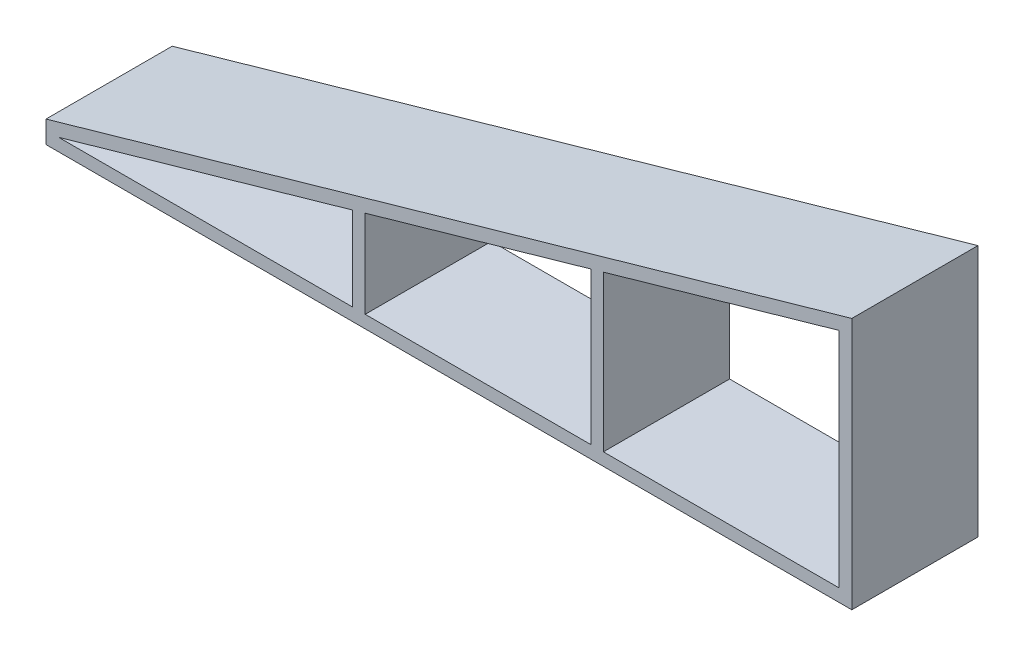
ISO-10303-21;
HEADER;
FILE_DESCRIPTION(('STEP AP214'),'2;1');
FILE_NAME('part.step','',(''),(''),'','','');
FILE_SCHEMA(('AUTOMOTIVE_DESIGN { 1 0 10303 214 1 1 1 1 }'));
ENDSEC;
DATA;
#1=APPLICATION_CONTEXT('core data for automotive mechanical design processes');
#2=APPLICATION_PROTOCOL_DEFINITION('international standard','automotive_design',2000,#1);
#3=PRODUCT_CONTEXT('',#1,'mechanical');
#4=PRODUCT('Part','Part','',(#3));
#5=PRODUCT_RELATED_PRODUCT_CATEGORY('part','',(#4));
#6=PRODUCT_DEFINITION_FORMATION('','',#4);
#7=PRODUCT_DEFINITION_CONTEXT('part definition',#1,'design');
#8=PRODUCT_DEFINITION('design','',#6,#7);
#9=PRODUCT_DEFINITION_SHAPE('','',#8);
#10=(LENGTH_UNIT() NAMED_UNIT(*) SI_UNIT(.MILLI.,.METRE.));
#11=(NAMED_UNIT(*) PLANE_ANGLE_UNIT() SI_UNIT($,.RADIAN.));
#12=(NAMED_UNIT(*) SI_UNIT($,.STERADIAN.) SOLID_ANGLE_UNIT());
#13=UNCERTAINTY_MEASURE_WITH_UNIT(LENGTH_MEASURE(1.E-05),#10,'distance_accuracy_value','');
#14=(GEOMETRIC_REPRESENTATION_CONTEXT(3) GLOBAL_UNCERTAINTY_ASSIGNED_CONTEXT((#13)) GLOBAL_UNIT_ASSIGNED_CONTEXT((#10,
#11,#12)) REPRESENTATION_CONTEXT('',''));
#15=CARTESIAN_POINT('',(0.,0.,0.));
#16=DIRECTION('',(0.,0.,1.));
#17=DIRECTION('',(1.,0.,0.));
#18=AXIS2_PLACEMENT_3D('',#15,#16,#17);
#19=CARTESIAN_POINT('',(0.,-13.414149003123,10.));
#20=DIRECTION('',(0.,-1.,0.));
#21=DIRECTION('',(1.,0.,0.));
#22=AXIS2_PLACEMENT_3D('',#19,#20,#21);
#23=PLANE('',#22);
#24=DIRECTION('',(-1.,0.,0.));
#25=VECTOR('',#24,1.);
#26=CARTESIAN_POINT('',(0.,-13.414149003123,0.));
#27=LINE('',#26,#25);
#28=CARTESIAN_POINT('',(-11.0833527313562,-13.414149003123,0.));
#29=VERTEX_POINT('',#28);
#30=CARTESIAN_POINT('',(-34.3799465863682,-13.414149003123,0.));
#31=VERTEX_POINT('',#30);
#32=EDGE_CURVE('E175',#29,#31,#27,.T.);
#33=ORIENTED_EDGE('',*,*,#32,.T.);
#34=DIRECTION('',(0.,0.,-1.));
#35=VECTOR('',#34,1.);
#36=CARTESIAN_POINT('',(-34.3799465863682,-13.414149003123,10.));
#37=LINE('',#36,#35);
#38=CARTESIAN_POINT('',(-34.3799465863682,-13.414149003123,10.));
#39=VERTEX_POINT('',#38);
#40=EDGE_CURVE('E11',#39,#31,#37,.T.);
#41=ORIENTED_EDGE('',*,*,#40,.F.);
#42=DIRECTION('',(-1.,0.,0.));
#43=VECTOR('',#42,1.);
#44=CARTESIAN_POINT('',(0.,-13.414149003123,10.));
#45=LINE('',#44,#43);
#46=CARTESIAN_POINT('',(-11.0833527313562,-13.414149003123,10.));
#47=VERTEX_POINT('',#46);
#48=EDGE_CURVE('E166',#47,#39,#45,.T.);
#49=ORIENTED_EDGE('',*,*,#48,.F.);
#50=DIRECTION('',(0.,0.,-1.));
#51=VECTOR('',#50,1.);
#52=CARTESIAN_POINT('',(-11.0833527313562,-13.414149003123,10.));
#53=LINE('',#52,#51);
#54=EDGE_CURVE('E176',#47,#29,#53,.T.);
#55=ORIENTED_EDGE('',*,*,#54,.T.);
#56=EDGE_LOOP('',(#33,#41,#49,#55));
#57=FACE_BOUND('',#56,.T.);
#58=ADVANCED_FACE('F45',(#57),#23,.F.);
#59=CARTESIAN_POINT('',(0.948647164117915,-3.3202650744127,10.));
#60=DIRECTION('',(-0.274721127897379,0.961523947640823,0.));
#61=DIRECTION('',(-0.961523947640823,-0.274721127897379,0.));
#62=AXIS2_PLACEMENT_3D('',#59,#60,#61);
#63=PLANE('',#62);
#64=DIRECTION('',(0.961523947640823,0.274721127897379,0.));
#65=VECTOR('',#64,1.);
#66=CARTESIAN_POINT('',(0.948647164117915,-3.3202650744127,0.));
#67=LINE('',#66,#65);
#68=CARTESIAN_POINT('',(-11.0833527313562,-6.75797933026244,0.));
#69=VERTEX_POINT('',#68);
#70=EDGE_CURVE('E113',#31,#69,#67,.T.);
#71=ORIENTED_EDGE('',*,*,#70,.T.);
#72=DIRECTION('',(0.,0.,-1.));
#73=VECTOR('',#72,1.);
#74=CARTESIAN_POINT('',(-11.0833527313562,-6.75797933026244,10.));
#75=LINE('',#74,#73);
#76=CARTESIAN_POINT('',(-11.0833527313562,-6.75797933026244,10.));
#77=VERTEX_POINT('',#76);
#78=EDGE_CURVE('E56',#77,#69,#75,.T.);
#79=ORIENTED_EDGE('',*,*,#78,.F.);
#80=DIRECTION('',(0.961523947640823,0.274721127897379,0.));
#81=VECTOR('',#80,1.);
#82=CARTESIAN_POINT('',(0.948647164117915,-3.3202650744127,10.));
#83=LINE('',#82,#81);
#84=EDGE_CURVE('E161',#39,#77,#83,.T.);
#85=ORIENTED_EDGE('',*,*,#84,.F.);
#86=ORIENTED_EDGE('',*,*,#40,.T.);
#87=EDGE_LOOP('',(#71,#79,#85,#86));
#88=FACE_BOUND('',#87,.T.);
#89=ADVANCED_FACE('F162',(#88),#63,.F.);
#90=CARTESIAN_POINT('',(-10.0833527313562,0.,10.));
#91=DIRECTION('',(-1.,0.,0.));
#92=DIRECTION('',(0.,-1.,0.));
#93=AXIS2_PLACEMENT_3D('',#90,#91,#92);
#94=PLANE('',#93);
#95=DIRECTION('',(0.,1.,0.));
#96=VECTOR('',#95,1.);
#97=CARTESIAN_POINT('',(-10.0833527313562,0.,0.));
#98=LINE('',#97,#96);
#99=CARTESIAN_POINT('',(-10.0833527313562,-13.414149003123,0.));
#100=VERTEX_POINT('',#99);
#101=CARTESIAN_POINT('',(-10.0833527313562,-6.47226504454815,0.));
#102=VERTEX_POINT('',#101);
#103=EDGE_CURVE('E279',#100,#102,#98,.T.);
#104=ORIENTED_EDGE('',*,*,#103,.T.);
#105=DIRECTION('',(0.,0.,-1.));
#106=VECTOR('',#105,1.);
#107=CARTESIAN_POINT('',(-10.0833527313562,-6.47226504454815,10.));
#108=LINE('',#107,#106);
#109=CARTESIAN_POINT('',(-10.0833527313562,-6.47226504454815,10.));
#110=VERTEX_POINT('',#109);
#111=EDGE_CURVE('E193',#110,#102,#108,.T.);
#112=ORIENTED_EDGE('',*,*,#111,.F.);
#113=DIRECTION('',(0.,1.,0.));
#114=VECTOR('',#113,1.);
#115=CARTESIAN_POINT('',(-10.0833527313562,0.,10.));
#116=LINE('',#115,#114);
#117=CARTESIAN_POINT('',(-10.0833527313562,-13.414149003123,10.));
#118=VERTEX_POINT('',#117);
#119=EDGE_CURVE('E304',#118,#110,#116,.T.);
#120=ORIENTED_EDGE('',*,*,#119,.F.);
#121=DIRECTION('',(0.,0.,-1.));
#122=VECTOR('',#121,1.);
#123=CARTESIAN_POINT('',(-10.0833527313562,-13.414149003123,10.));
#124=LINE('',#123,#122);
#125=EDGE_CURVE('E196',#118,#100,#124,.T.);
#126=ORIENTED_EDGE('',*,*,#125,.T.);
#127=EDGE_LOOP('',(#104,#112,#120,#126));
#128=FACE_BOUND('',#127,.T.);
#129=ADVANCED_FACE('F301',(#128),#94,.F.);
#130=CARTESIAN_POINT('',(0.948647164117915,-3.3202650744127,10.));
#131=DIRECTION('',(-0.274721127897378,0.961523947640823,0.));
#132=DIRECTION('',(-0.961523947640823,-0.274721127897378,0.));
#133=AXIS2_PLACEMENT_3D('',#130,#131,#132);
#134=PLANE('',#133);
#135=DIRECTION('',(0.961523947640823,0.274721127897378,0.));
#136=VECTOR('',#135,1.);
#137=CARTESIAN_POINT('',(0.948647164117915,-3.3202650744127,0.));
#138=LINE('',#137,#136);
#139=CARTESIAN_POINT('',(7.79491509356159,-1.36418852314307,0.));
#140=VERTEX_POINT('',#139);
#141=EDGE_CURVE('E283',#102,#140,#138,.T.);
#142=ORIENTED_EDGE('',*,*,#141,.T.);
#143=DIRECTION('',(0.,0.,-1.));
#144=VECTOR('',#143,1.);
#145=CARTESIAN_POINT('',(7.79491509356159,-1.36418852314307,10.));
#146=LINE('',#145,#144);
#147=CARTESIAN_POINT('',(7.79491509356159,-1.36418852314307,10.));
#148=VERTEX_POINT('',#147);
#149=EDGE_CURVE('E205',#148,#140,#146,.T.);
#150=ORIENTED_EDGE('',*,*,#149,.F.);
#151=DIRECTION('',(0.961523947640823,0.274721127897378,0.));
#152=VECTOR('',#151,1.);
#153=CARTESIAN_POINT('',(0.948647164117915,-3.3202650744127,10.));
#154=LINE('',#153,#152);
#155=EDGE_CURVE('E307',#110,#148,#154,.T.);
#156=ORIENTED_EDGE('',*,*,#155,.F.);
#157=ORIENTED_EDGE('',*,*,#111,.T.);
#158=EDGE_LOOP('',(#142,#150,#156,#157));
#159=FACE_BOUND('',#158,.T.);
#160=ADVANCED_FACE('F323',(#159),#134,.F.);
#161=CARTESIAN_POINT('',(7.79491509356159,0.,10.));
#162=DIRECTION('',(1.,0.,0.));
#163=DIRECTION('',(0.,1.,0.));
#164=AXIS2_PLACEMENT_3D('',#161,#162,#163);
#165=PLANE('',#164);
#166=DIRECTION('',(0.,-1.,0.));
#167=VECTOR('',#166,1.);
#168=CARTESIAN_POINT('',(7.79491509356159,0.,0.));
#169=LINE('',#168,#167);
#170=CARTESIAN_POINT('',(7.79491509356159,-13.414149003123,0.));
#171=VERTEX_POINT('',#170);
#172=EDGE_CURVE('E184',#140,#171,#169,.T.);
#173=ORIENTED_EDGE('',*,*,#172,.T.);
#174=DIRECTION('',(0.,0.,-1.));
#175=VECTOR('',#174,1.);
#176=CARTESIAN_POINT('',(7.79491509356159,-13.414149003123,10.));
#177=LINE('',#176,#175);
#178=CARTESIAN_POINT('',(7.79491509356159,-13.414149003123,10.));
#179=VERTEX_POINT('',#178);
#180=EDGE_CURVE('E200',#179,#171,#177,.T.);
#181=ORIENTED_EDGE('',*,*,#180,.F.);
#182=DIRECTION('',(0.,-1.,0.));
#183=VECTOR('',#182,1.);
#184=CARTESIAN_POINT('',(7.79491509356159,0.,10.));
#185=LINE('',#184,#183);
#186=EDGE_CURVE('E312',#148,#179,#185,.T.);
#187=ORIENTED_EDGE('',*,*,#186,.F.);
#188=ORIENTED_EDGE('',*,*,#149,.T.);
#189=EDGE_LOOP('',(#173,#181,#187,#188));
#190=FACE_BOUND('',#189,.T.);
#191=ADVANCED_FACE('F289',(#190),#165,.F.);
#192=CARTESIAN_POINT('',(8.79491509356159,0.,10.));
#193=DIRECTION('',(-1.,0.,0.));
#194=DIRECTION('',(0.,0.,1.));
#195=AXIS2_PLACEMENT_3D('',#192,#193,#194);
#196=PLANE('',#195);
#197=DIRECTION('',(0.,1.,0.));
#198=VECTOR('',#197,1.);
#199=CARTESIAN_POINT('',(8.79491509356159,0.,0.));
#200=LINE('',#199,#198);
#201=CARTESIAN_POINT('',(8.79491509356159,-13.414149003123,0.));
#202=VERTEX_POINT('',#201);
#203=CARTESIAN_POINT('',(8.79491509356159,-1.07847423742879,0.));
#204=VERTEX_POINT('',#203);
#205=EDGE_CURVE('E266',#202,#204,#200,.T.);
#206=ORIENTED_EDGE('',*,*,#205,.T.);
#207=DIRECTION('',(0.,0.,-1.));
#208=VECTOR('',#207,1.);
#209=CARTESIAN_POINT('',(8.79491509356159,-1.07847423742879,10.));
#210=LINE('',#209,#208);
#211=CARTESIAN_POINT('',(8.79491509356159,-1.07847423742879,10.));
#212=VERTEX_POINT('',#211);
#213=EDGE_CURVE('E201',#212,#204,#210,.T.);
#214=ORIENTED_EDGE('',*,*,#213,.F.);
#215=DIRECTION('',(0.,1.,0.));
#216=VECTOR('',#215,1.);
#217=CARTESIAN_POINT('',(8.79491509356159,0.,10.));
#218=LINE('',#217,#216);
#219=CARTESIAN_POINT('',(8.79491509356159,-13.414149003123,10.));
#220=VERTEX_POINT('',#219);
#221=EDGE_CURVE('E384',#220,#212,#218,.T.);
#222=ORIENTED_EDGE('',*,*,#221,.F.);
#223=DIRECTION('',(0.,0.,-1.));
#224=VECTOR('',#223,1.);
#225=CARTESIAN_POINT('',(8.79491509356159,-13.414149003123,10.));
#226=LINE('',#225,#224);
#227=EDGE_CURVE('E212',#220,#202,#226,.T.);
#228=ORIENTED_EDGE('',*,*,#227,.T.);
#229=EDGE_LOOP('',(#206,#214,#222,#228));
#230=FACE_BOUND('',#229,.T.);
#231=ADVANCED_FACE('F330',(#230),#196,.F.);
#232=CARTESIAN_POINT('',(0.948647164117915,-3.3202650744127,10.));
#233=DIRECTION('',(-0.274721127897378,0.961523947640823,0.));
#234=DIRECTION('',(-0.961523947640823,-0.274721127897378,0.));
#235=AXIS2_PLACEMENT_3D('',#232,#233,#234);
#236=PLANE('',#235);
#237=DIRECTION('',(0.961523947640823,0.274721127897378,0.));
#238=VECTOR('',#237,1.);
#239=CARTESIAN_POINT('',(0.948647164117915,-3.3202650744127,0.));
#240=LINE('',#239,#238);
#241=CARTESIAN_POINT('',(27.4799984689915,4.26012101269404,0.));
#242=VERTEX_POINT('',#241);
#243=EDGE_CURVE('E270',#204,#242,#240,.T.);
#244=ORIENTED_EDGE('',*,*,#243,.T.);
#245=DIRECTION('',(0.,0.,-1.));
#246=VECTOR('',#245,1.);
#247=CARTESIAN_POINT('',(27.4799984689915,4.26012101269404,10.));
#248=LINE('',#247,#246);
#249=CARTESIAN_POINT('',(27.4799984689915,4.26012101269404,10.));
#250=VERTEX_POINT('',#249);
#251=EDGE_CURVE('E220',#250,#242,#248,.T.);
#252=ORIENTED_EDGE('',*,*,#251,.F.);
#253=DIRECTION('',(0.961523947640823,0.274721127897378,0.));
#254=VECTOR('',#253,1.);
#255=CARTESIAN_POINT('',(0.948647164117915,-3.3202650744127,10.));
#256=LINE('',#255,#254);
#257=EDGE_CURVE('E387',#212,#250,#256,.T.);
#258=ORIENTED_EDGE('',*,*,#257,.F.);
#259=ORIENTED_EDGE('',*,*,#213,.T.);
#260=EDGE_LOOP('',(#244,#252,#258,#259));
#261=FACE_BOUND('',#260,.T.);
#262=ADVANCED_FACE('F362',(#261),#236,.F.);
#263=CARTESIAN_POINT('',(27.4799984689915,0.,10.));
#264=DIRECTION('',(1.,0.,0.));
#265=DIRECTION('',(0.,1.,0.));
#266=AXIS2_PLACEMENT_3D('',#263,#264,#265);
#267=PLANE('',#266);
#268=DIRECTION('',(0.,-1.,0.));
#269=VECTOR('',#268,1.);
#270=CARTESIAN_POINT('',(27.4799984689915,0.,0.));
#271=LINE('',#270,#269);
#272=CARTESIAN_POINT('',(27.4799984689915,-13.414149003123,0.));
#273=VERTEX_POINT('',#272);
#274=EDGE_CURVE('E273',#242,#273,#271,.T.);
#275=ORIENTED_EDGE('',*,*,#274,.T.);
#276=DIRECTION('',(0.,0.,-1.));
#277=VECTOR('',#276,1.);
#278=CARTESIAN_POINT('',(27.4799984689915,-13.414149003123,10.));
#279=LINE('',#278,#277);
#280=CARTESIAN_POINT('',(27.4799984689915,-13.414149003123,10.));
#281=VERTEX_POINT('',#280);
#282=EDGE_CURVE('E216',#281,#273,#279,.T.);
#283=ORIENTED_EDGE('',*,*,#282,.F.);
#284=DIRECTION('',(0.,-1.,0.));
#285=VECTOR('',#284,1.);
#286=CARTESIAN_POINT('',(27.4799984689915,0.,10.));
#287=LINE('',#286,#285);
#288=EDGE_CURVE('E314',#250,#281,#287,.T.);
#289=ORIENTED_EDGE('',*,*,#288,.F.);
#290=ORIENTED_EDGE('',*,*,#251,.T.);
#291=EDGE_LOOP('',(#275,#283,#289,#290));
#292=FACE_BOUND('',#291,.T.);
#293=ADVANCED_FACE('F366',(#292),#267,.F.);
#294=CARTESIAN_POINT('',(-35.3799465863682,0.,10.));
#295=DIRECTION('',(-1.,0.,0.));
#296=DIRECTION('',(0.,0.,1.));
#297=AXIS2_PLACEMENT_3D('',#294,#295,#296);
#298=PLANE('',#297);
#299=DIRECTION('',(0.,1.,0.));
#300=VECTOR('',#299,1.);
#301=CARTESIAN_POINT('',(-35.3799465863682,0.,0.));
#302=LINE('',#301,#300);
#303=CARTESIAN_POINT('',(-35.3799465863682,-14.414149003123,0.));
#304=VERTEX_POINT('',#303);
#305=CARTESIAN_POINT('',(-35.3799465863682,-12.6598475903687,0.));
#306=VERTEX_POINT('',#305);
#307=EDGE_CURVE('E248',#304,#306,#302,.T.);
#308=ORIENTED_EDGE('',*,*,#307,.F.);
#309=DIRECTION('',(0.,0.,-1.));
#310=VECTOR('',#309,1.);
#311=CARTESIAN_POINT('',(-35.3799465863682,-14.414149003123,10.));
#312=LINE('',#311,#310);
#313=CARTESIAN_POINT('',(-35.3799465863682,-14.414149003123,10.));
#314=VERTEX_POINT('',#313);
#315=EDGE_CURVE('E49',#314,#304,#312,.T.);
#316=ORIENTED_EDGE('',*,*,#315,.F.);
#317=DIRECTION('',(0.,1.,0.));
#318=VECTOR('',#317,1.);
#319=CARTESIAN_POINT('',(-35.3799465863682,0.,10.));
#320=LINE('',#319,#318);
#321=CARTESIAN_POINT('',(-35.3799465863682,-12.6598475903687,10.));
#322=VERTEX_POINT('',#321);
#323=EDGE_CURVE('E190',#314,#322,#320,.T.);
#324=ORIENTED_EDGE('',*,*,#323,.T.);
#325=DIRECTION('',(0.,0.,-1.));
#326=VECTOR('',#325,1.);
#327=CARTESIAN_POINT('',(-35.3799465863682,-12.6598475903687,10.));
#328=LINE('',#327,#326);
#329=EDGE_CURVE('E227',#322,#306,#328,.T.);
#330=ORIENTED_EDGE('',*,*,#329,.T.);
#331=EDGE_LOOP('',(#308,#316,#324,#330));
#332=FACE_BOUND('',#331,.T.);
#333=ADVANCED_FACE('F47',(#332),#298,.T.);
#334=CARTESIAN_POINT('',(0.,-14.414149003123,10.));
#335=DIRECTION('',(0.,-1.,0.));
#336=DIRECTION('',(1.,0.,0.));
#337=AXIS2_PLACEMENT_3D('',#334,#335,#336);
#338=PLANE('',#337);
#339=DIRECTION('',(-1.,0.,0.));
#340=VECTOR('',#339,1.);
#341=CARTESIAN_POINT('',(0.,-14.414149003123,0.));
#342=LINE('',#341,#340);
#343=CARTESIAN_POINT('',(28.4799984689915,-14.414149003123,0.));
#344=VERTEX_POINT('',#343);
#345=EDGE_CURVE('E243',#344,#304,#342,.T.);
#346=ORIENTED_EDGE('',*,*,#345,.F.);
#347=DIRECTION('',(0.,0.,-1.));
#348=VECTOR('',#347,1.);
#349=CARTESIAN_POINT('',(28.4799984689915,-14.414149003123,10.));
#350=LINE('',#349,#348);
#351=CARTESIAN_POINT('',(28.4799984689915,-14.414149003123,10.));
#352=VERTEX_POINT('',#351);
#353=EDGE_CURVE('E232',#352,#344,#350,.T.);
#354=ORIENTED_EDGE('',*,*,#353,.F.);
#355=DIRECTION('',(-1.,0.,0.));
#356=VECTOR('',#355,1.);
#357=CARTESIAN_POINT('',(0.,-14.414149003123,10.));
#358=LINE('',#357,#356);
#359=EDGE_CURVE('E246',#352,#314,#358,.T.);
#360=ORIENTED_EDGE('',*,*,#359,.T.);
#361=ORIENTED_EDGE('',*,*,#315,.T.);
#362=EDGE_LOOP('',(#346,#354,#360,#361));
#363=FACE_BOUND('',#362,.T.);
#364=ADVANCED_FACE('F241',(#363),#338,.T.);
#365=CARTESIAN_POINT('',(28.4799984689915,0.,10.));
#366=DIRECTION('',(1.,0.,0.));
#367=DIRECTION('',(0.,1.,0.));
#368=AXIS2_PLACEMENT_3D('',#365,#366,#367);
#369=PLANE('',#368);
#370=DIRECTION('',(0.,-1.,0.));
#371=VECTOR('',#370,1.);
#372=CARTESIAN_POINT('',(28.4799984689915,0.,0.));
#373=LINE('',#372,#371);
#374=CARTESIAN_POINT('',(28.4799984689915,5.58585099687697,0.));
#375=VERTEX_POINT('',#374);
#376=EDGE_CURVE('E256',#375,#344,#373,.T.);
#377=ORIENTED_EDGE('',*,*,#376,.F.);
#378=DIRECTION('',(0.,0.,-1.));
#379=VECTOR('',#378,1.);
#380=CARTESIAN_POINT('',(28.4799984689915,5.58585099687697,10.));
#381=LINE('',#380,#379);
#382=CARTESIAN_POINT('',(28.4799984689915,5.58585099687697,10.));
#383=VERTEX_POINT('',#382);
#384=EDGE_CURVE('E230',#383,#375,#381,.T.);
#385=ORIENTED_EDGE('',*,*,#384,.F.);
#386=DIRECTION('',(0.,-1.,0.));
#387=VECTOR('',#386,1.);
#388=CARTESIAN_POINT('',(28.4799984689915,0.,10.));
#389=LINE('',#388,#387);
#390=EDGE_CURVE('E394',#383,#352,#389,.T.);
#391=ORIENTED_EDGE('',*,*,#390,.T.);
#392=ORIENTED_EDGE('',*,*,#353,.T.);
#393=EDGE_LOOP('',(#377,#385,#391,#392));
#394=FACE_BOUND('',#393,.T.);
#395=ADVANCED_FACE('F343',(#394),#369,.T.);
#396=CARTESIAN_POINT('',(0.,-13.414149003123,10.));
#397=DIRECTION('',(0.,-1.,0.));
#398=DIRECTION('',(1.,0.,0.));
#399=AXIS2_PLACEMENT_3D('',#396,#397,#398);
#400=PLANE('',#399);
#401=DIRECTION('',(-1.,0.,0.));
#402=VECTOR('',#401,1.);
#403=CARTESIAN_POINT('',(0.,-13.414149003123,0.));
#404=LINE('',#403,#402);
#405=EDGE_CURVE('E179',#171,#100,#404,.T.);
#406=ORIENTED_EDGE('',*,*,#405,.T.);
#407=ORIENTED_EDGE('',*,*,#125,.F.);
#408=DIRECTION('',(-1.,0.,0.));
#409=VECTOR('',#408,1.);
#410=CARTESIAN_POINT('',(0.,-13.414149003123,10.));
#411=LINE('',#410,#409);
#412=EDGE_CURVE('E172',#179,#118,#411,.T.);
#413=ORIENTED_EDGE('',*,*,#412,.F.);
#414=ORIENTED_EDGE('',*,*,#180,.T.);
#415=EDGE_LOOP('',(#406,#407,#413,#414));
#416=FACE_BOUND('',#415,.T.);
#417=ADVANCED_FACE('F296',(#416),#400,.F.);
#418=CARTESIAN_POINT('',(0.,-13.414149003123,10.));
#419=DIRECTION('',(0.,-1.,0.));
#420=DIRECTION('',(1.,0.,0.));
#421=AXIS2_PLACEMENT_3D('',#418,#419,#420);
#422=PLANE('',#421);
#423=DIRECTION('',(-1.,0.,0.));
#424=VECTOR('',#423,1.);
#425=CARTESIAN_POINT('',(0.,-13.414149003123,0.));
#426=LINE('',#425,#424);
#427=EDGE_CURVE('E276',#273,#202,#426,.T.);
#428=ORIENTED_EDGE('',*,*,#427,.T.);
#429=ORIENTED_EDGE('',*,*,#227,.F.);
#430=DIRECTION('',(-1.,0.,0.));
#431=VECTOR('',#430,1.);
#432=CARTESIAN_POINT('',(0.,-13.414149003123,10.));
#433=LINE('',#432,#431);
#434=EDGE_CURVE('E308',#281,#220,#433,.T.);
#435=ORIENTED_EDGE('',*,*,#434,.F.);
#436=ORIENTED_EDGE('',*,*,#282,.T.);
#437=EDGE_LOOP('',(#428,#429,#435,#436));
#438=FACE_BOUND('',#437,.T.);
#439=ADVANCED_FACE('F342',(#438),#422,.F.);
#440=CARTESIAN_POINT('',(0.673926036220537,-2.35874112677188,10.));
#441=DIRECTION('',(-0.274721127897378,0.961523947640823,0.));
#442=DIRECTION('',(-0.961523947640823,-0.274721127897378,0.));
#443=AXIS2_PLACEMENT_3D('',#440,#441,#442);
#444=PLANE('',#443);
#445=DIRECTION('',(0.961523947640823,0.274721127897378,0.));
#446=VECTOR('',#445,1.);
#447=CARTESIAN_POINT('',(0.673926036220537,-2.35874112677188,0.));
#448=LINE('',#447,#446);
#449=EDGE_CURVE('E260',#306,#375,#448,.T.);
#450=ORIENTED_EDGE('',*,*,#449,.F.);
#451=ORIENTED_EDGE('',*,*,#329,.F.);
#452=DIRECTION('',(0.961523947640823,0.274721127897378,0.));
#453=VECTOR('',#452,1.);
#454=CARTESIAN_POINT('',(0.673926036220537,-2.35874112677188,10.));
#455=LINE('',#454,#453);
#456=EDGE_CURVE('E388',#322,#383,#455,.T.);
#457=ORIENTED_EDGE('',*,*,#456,.T.);
#458=ORIENTED_EDGE('',*,*,#384,.T.);
#459=EDGE_LOOP('',(#450,#451,#457,#458));
#460=FACE_BOUND('',#459,.T.);
#461=ADVANCED_FACE('F348',(#460),#444,.T.);
#462=CARTESIAN_POINT('',(-11.0833527313562,0.,10.));
#463=DIRECTION('',(1.,0.,0.));
#464=DIRECTION('',(0.,1.,0.));
#465=AXIS2_PLACEMENT_3D('',#462,#463,#464);
#466=PLANE('',#465);
#467=DIRECTION('',(0.,-1.,0.));
#468=VECTOR('',#467,1.);
#469=CARTESIAN_POINT('',(-11.0833527313562,0.,0.));
#470=LINE('',#469,#468);
#471=EDGE_CURVE('E119',#69,#29,#470,.T.);
#472=ORIENTED_EDGE('',*,*,#471,.T.);
#473=ORIENTED_EDGE('',*,*,#54,.F.);
#474=DIRECTION('',(0.,-1.,0.));
#475=VECTOR('',#474,1.);
#476=CARTESIAN_POINT('',(-11.0833527313562,0.,10.));
#477=LINE('',#476,#475);
#478=EDGE_CURVE('E65',#77,#47,#477,.T.);
#479=ORIENTED_EDGE('',*,*,#478,.F.);
#480=ORIENTED_EDGE('',*,*,#78,.T.);
#481=EDGE_LOOP('',(#472,#473,#479,#480));
#482=FACE_BOUND('',#481,.T.);
#483=ADVANCED_FACE('F358',(#482),#466,.F.);
#484=CARTESIAN_POINT('',(0.,0.,10.));
#485=DIRECTION('',(0.,0.,1.));
#486=DIRECTION('',(1.,0.,0.));
#487=AXIS2_PLACEMENT_3D('',#484,#485,#486);
#488=PLANE('',#487);
#489=ORIENTED_EDGE('',*,*,#323,.F.);
#490=ORIENTED_EDGE('',*,*,#359,.F.);
#491=ORIENTED_EDGE('',*,*,#390,.F.);
#492=ORIENTED_EDGE('',*,*,#456,.F.);
#493=EDGE_LOOP('',(#489,#490,#491,#492));
#494=FACE_BOUND('',#493,.T.);
#495=ORIENTED_EDGE('',*,*,#221,.T.);
#496=ORIENTED_EDGE('',*,*,#257,.T.);
#497=ORIENTED_EDGE('',*,*,#288,.T.);
#498=ORIENTED_EDGE('',*,*,#434,.T.);
#499=EDGE_LOOP('',(#495,#496,#497,#498));
#500=FACE_BOUND('',#499,.T.);
#501=ORIENTED_EDGE('',*,*,#119,.T.);
#502=ORIENTED_EDGE('',*,*,#155,.T.);
#503=ORIENTED_EDGE('',*,*,#186,.T.);
#504=ORIENTED_EDGE('',*,*,#412,.T.);
#505=EDGE_LOOP('',(#501,#502,#503,#504));
#506=FACE_BOUND('',#505,.T.);
#507=ORIENTED_EDGE('',*,*,#48,.T.);
#508=ORIENTED_EDGE('',*,*,#84,.T.);
#509=ORIENTED_EDGE('',*,*,#478,.T.);
#510=EDGE_LOOP('',(#507,#508,#509));
#511=FACE_BOUND('',#510,.T.);
#512=ADVANCED_FACE('F169',(#494,#500,#506,#511),#488,.T.);
#513=CARTESIAN_POINT('',(0.,0.,0.));
#514=DIRECTION('',(0.,0.,1.));
#515=DIRECTION('',(1.,0.,0.));
#516=AXIS2_PLACEMENT_3D('',#513,#514,#515);
#517=PLANE('',#516);
#518=ORIENTED_EDGE('',*,*,#307,.T.);
#519=ORIENTED_EDGE('',*,*,#449,.T.);
#520=ORIENTED_EDGE('',*,*,#376,.T.);
#521=ORIENTED_EDGE('',*,*,#345,.T.);
#522=EDGE_LOOP('',(#518,#519,#520,#521));
#523=FACE_BOUND('',#522,.T.);
#524=ORIENTED_EDGE('',*,*,#205,.F.);
#525=ORIENTED_EDGE('',*,*,#427,.F.);
#526=ORIENTED_EDGE('',*,*,#274,.F.);
#527=ORIENTED_EDGE('',*,*,#243,.F.);
#528=EDGE_LOOP('',(#524,#525,#526,#527));
#529=FACE_BOUND('',#528,.T.);
#530=ORIENTED_EDGE('',*,*,#103,.F.);
#531=ORIENTED_EDGE('',*,*,#405,.F.);
#532=ORIENTED_EDGE('',*,*,#172,.F.);
#533=ORIENTED_EDGE('',*,*,#141,.F.);
#534=EDGE_LOOP('',(#530,#531,#532,#533));
#535=FACE_BOUND('',#534,.T.);
#536=ORIENTED_EDGE('',*,*,#32,.F.);
#537=ORIENTED_EDGE('',*,*,#471,.F.);
#538=ORIENTED_EDGE('',*,*,#70,.F.);
#539=EDGE_LOOP('',(#536,#537,#538));
#540=FACE_BOUND('',#539,.T.);
#541=ADVANCED_FACE('F254',(#523,#529,#535,#540),#517,.F.);
#542=CLOSED_SHELL('',(#58,#89,#129,#160,#191,#231,#262,#293,#333,#364,#395,#417,#439,#461,#483,
#512,#541));
#543=MANIFOLD_SOLID_BREP('B2',#542);
#544=ADVANCED_BREP_SHAPE_REPRESENTATION('',(#18,#543),#14);
#545=SHAPE_DEFINITION_REPRESENTATION(#9,#544);
ENDSEC;
END-ISO-10303-21;
